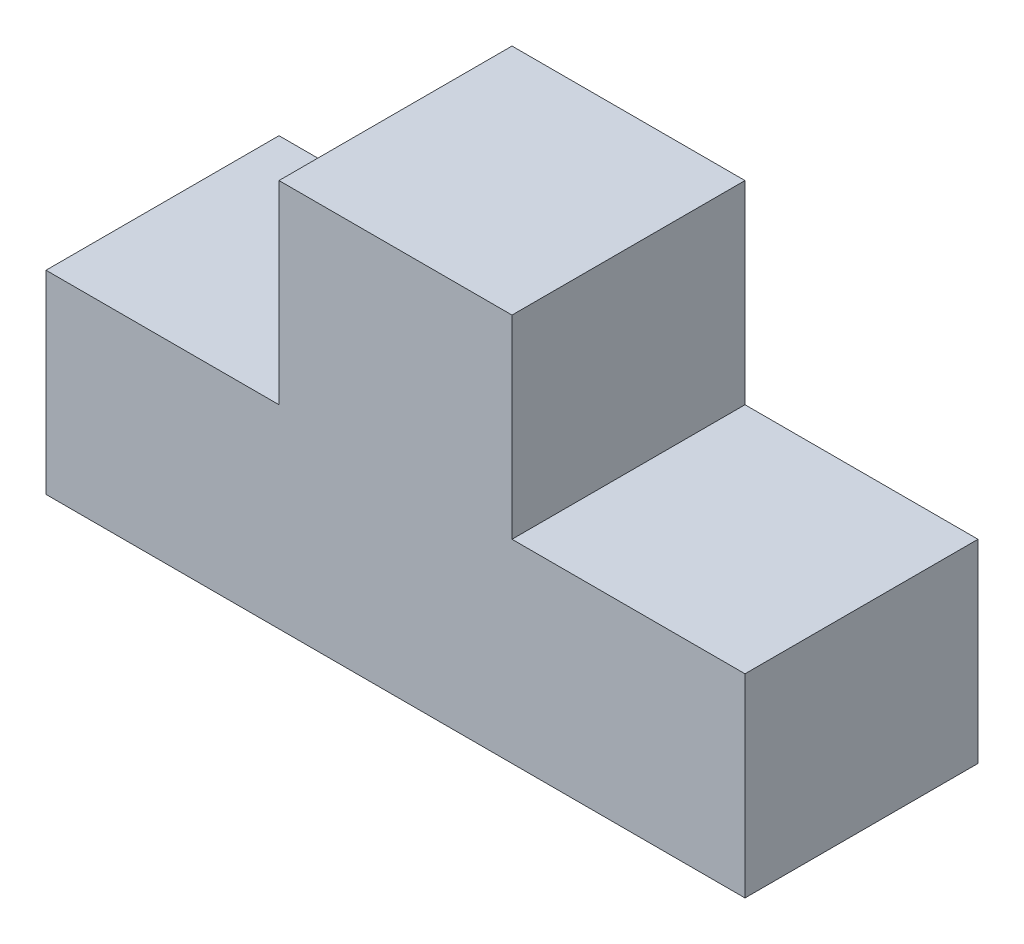
ISO-10303-21;
HEADER;
FILE_DESCRIPTION(('STEP AP214'),'2;1');
FILE_NAME('part.step','',(''),(''),'','','');
FILE_SCHEMA(('AUTOMOTIVE_DESIGN { 1 0 10303 214 1 1 1 1 }'));
ENDSEC;
DATA;
#1=APPLICATION_CONTEXT('core data for automotive mechanical design processes');
#2=APPLICATION_PROTOCOL_DEFINITION('international standard','automotive_design',2000,#1);
#3=PRODUCT_CONTEXT('',#1,'mechanical');
#4=PRODUCT('Part','Part','',(#3));
#5=PRODUCT_RELATED_PRODUCT_CATEGORY('part','',(#4));
#6=PRODUCT_DEFINITION_FORMATION('','',#4);
#7=PRODUCT_DEFINITION_CONTEXT('part definition',#1,'design');
#8=PRODUCT_DEFINITION('design','',#6,#7);
#9=PRODUCT_DEFINITION_SHAPE('','',#8);
#10=(LENGTH_UNIT() NAMED_UNIT(*) SI_UNIT(.MILLI.,.METRE.));
#11=(NAMED_UNIT(*) PLANE_ANGLE_UNIT() SI_UNIT($,.RADIAN.));
#12=(NAMED_UNIT(*) SI_UNIT($,.STERADIAN.) SOLID_ANGLE_UNIT());
#13=UNCERTAINTY_MEASURE_WITH_UNIT(LENGTH_MEASURE(1.E-05),#10,'distance_accuracy_value','');
#14=(GEOMETRIC_REPRESENTATION_CONTEXT(3) GLOBAL_UNCERTAINTY_ASSIGNED_CONTEXT((#13)) GLOBAL_UNIT_ASSIGNED_CONTEXT((#10,
#11,#12)) REPRESENTATION_CONTEXT('',''));
#15=CARTESIAN_POINT('',(0.,0.,0.));
#16=DIRECTION('',(0.,0.,1.));
#17=DIRECTION('',(1.,0.,0.));
#18=AXIS2_PLACEMENT_3D('',#15,#16,#17);
#19=CARTESIAN_POINT('',(0.,25.,30.));
#20=DIRECTION('',(1.,0.,0.));
#21=DIRECTION('',(0.,0.,-1.));
#22=AXIS2_PLACEMENT_3D('',#19,#20,#21);
#23=PLANE('',#22);
#24=DIRECTION('',(0.,-1.,0.));
#25=VECTOR('',#24,1.);
#26=CARTESIAN_POINT('',(0.,25.,0.));
#27=LINE('',#26,#25);
#28=CARTESIAN_POINT('',(0.,25.,0.));
#29=VERTEX_POINT('',#28);
#30=CARTESIAN_POINT('',(0.,0.,0.));
#31=VERTEX_POINT('',#30);
#32=EDGE_CURVE('E129',#29,#31,#27,.T.);
#33=ORIENTED_EDGE('',*,*,#32,.T.);
#34=DIRECTION('',(0.,0.,-1.));
#35=VECTOR('',#34,1.);
#36=CARTESIAN_POINT('',(0.,0.,30.));
#37=LINE('',#36,#35);
#38=CARTESIAN_POINT('',(0.,0.,30.));
#39=VERTEX_POINT('',#38);
#40=EDGE_CURVE('E11',#39,#31,#37,.T.);
#41=ORIENTED_EDGE('',*,*,#40,.F.);
#42=DIRECTION('',(0.,-1.,0.));
#43=VECTOR('',#42,1.);
#44=CARTESIAN_POINT('',(0.,25.,30.));
#45=LINE('',#44,#43);
#46=CARTESIAN_POINT('',(0.,25.,30.));
#47=VERTEX_POINT('',#46);
#48=EDGE_CURVE('E143',#47,#39,#45,.T.);
#49=ORIENTED_EDGE('',*,*,#48,.F.);
#50=DIRECTION('',(0.,0.,-1.));
#51=VECTOR('',#50,1.);
#52=CARTESIAN_POINT('',(0.,25.,30.));
#53=LINE('',#52,#51);
#54=EDGE_CURVE('E125',#47,#29,#53,.T.);
#55=ORIENTED_EDGE('',*,*,#54,.T.);
#56=EDGE_LOOP('',(#33,#41,#49,#55));
#57=FACE_BOUND('',#56,.T.);
#58=ADVANCED_FACE('F33',(#57),#23,.F.);
#59=CARTESIAN_POINT('',(0.,0.,30.));
#60=DIRECTION('',(0.,1.,0.));
#61=DIRECTION('',(0.,0.,1.));
#62=AXIS2_PLACEMENT_3D('',#59,#60,#61);
#63=PLANE('',#62);
#64=DIRECTION('',(1.,0.,0.));
#65=VECTOR('',#64,1.);
#66=CARTESIAN_POINT('',(0.,0.,0.));
#67=LINE('',#66,#65);
#68=CARTESIAN_POINT('',(90.,0.,0.));
#69=VERTEX_POINT('',#68);
#70=EDGE_CURVE('E132',#31,#69,#67,.T.);
#71=ORIENTED_EDGE('',*,*,#70,.T.);
#72=DIRECTION('',(0.,0.,-1.));
#73=VECTOR('',#72,1.);
#74=CARTESIAN_POINT('',(90.,0.,30.));
#75=LINE('',#74,#73);
#76=CARTESIAN_POINT('',(90.,0.,30.));
#77=VERTEX_POINT('',#76);
#78=EDGE_CURVE('E41',#77,#69,#75,.T.);
#79=ORIENTED_EDGE('',*,*,#78,.F.);
#80=DIRECTION('',(1.,0.,0.));
#81=VECTOR('',#80,1.);
#82=CARTESIAN_POINT('',(0.,0.,30.));
#83=LINE('',#82,#81);
#84=EDGE_CURVE('E92',#39,#77,#83,.T.);
#85=ORIENTED_EDGE('',*,*,#84,.F.);
#86=ORIENTED_EDGE('',*,*,#40,.T.);
#87=EDGE_LOOP('',(#71,#79,#85,#86));
#88=FACE_BOUND('',#87,.T.);
#89=ADVANCED_FACE('F178',(#88),#63,.F.);
#90=CARTESIAN_POINT('',(90.,0.,30.));
#91=DIRECTION('',(-1.,0.,0.));
#92=DIRECTION('',(0.,0.,1.));
#93=AXIS2_PLACEMENT_3D('',#90,#91,#92);
#94=PLANE('',#93);
#95=DIRECTION('',(0.,1.,0.));
#96=VECTOR('',#95,1.);
#97=CARTESIAN_POINT('',(90.,0.,0.));
#98=LINE('',#97,#96);
#99=CARTESIAN_POINT('',(90.,25.,0.));
#100=VERTEX_POINT('',#99);
#101=EDGE_CURVE('E134',#69,#100,#98,.T.);
#102=ORIENTED_EDGE('',*,*,#101,.T.);
#103=DIRECTION('',(0.,0.,-1.));
#104=VECTOR('',#103,1.);
#105=CARTESIAN_POINT('',(90.,25.,30.));
#106=LINE('',#105,#104);
#107=CARTESIAN_POINT('',(90.,25.,30.));
#108=VERTEX_POINT('',#107);
#109=EDGE_CURVE('E150',#108,#100,#106,.T.);
#110=ORIENTED_EDGE('',*,*,#109,.F.);
#111=DIRECTION('',(0.,1.,0.));
#112=VECTOR('',#111,1.);
#113=CARTESIAN_POINT('',(90.,0.,30.));
#114=LINE('',#113,#112);
#115=EDGE_CURVE('E158',#77,#108,#114,.T.);
#116=ORIENTED_EDGE('',*,*,#115,.F.);
#117=ORIENTED_EDGE('',*,*,#78,.T.);
#118=EDGE_LOOP('',(#102,#110,#116,#117));
#119=FACE_BOUND('',#118,.T.);
#120=ADVANCED_FACE('F156',(#119),#94,.F.);
#121=CARTESIAN_POINT('',(90.,25.,30.));
#122=DIRECTION('',(0.,-1.,0.));
#123=DIRECTION('',(1.,0.,0.));
#124=AXIS2_PLACEMENT_3D('',#121,#122,#123);
#125=PLANE('',#124);
#126=DIRECTION('',(-1.,0.,0.));
#127=VECTOR('',#126,1.);
#128=CARTESIAN_POINT('',(90.,25.,0.));
#129=LINE('',#128,#127);
#130=CARTESIAN_POINT('',(60.,25.,0.));
#131=VERTEX_POINT('',#130);
#132=EDGE_CURVE('E136',#100,#131,#129,.T.);
#133=ORIENTED_EDGE('',*,*,#132,.T.);
#134=DIRECTION('',(0.,0.,-1.));
#135=VECTOR('',#134,1.);
#136=CARTESIAN_POINT('',(60.,25.,30.));
#137=LINE('',#136,#135);
#138=CARTESIAN_POINT('',(60.,25.,30.));
#139=VERTEX_POINT('',#138);
#140=EDGE_CURVE('E147',#139,#131,#137,.T.);
#141=ORIENTED_EDGE('',*,*,#140,.F.);
#142=DIRECTION('',(-1.,0.,0.));
#143=VECTOR('',#142,1.);
#144=CARTESIAN_POINT('',(90.,25.,30.));
#145=LINE('',#144,#143);
#146=EDGE_CURVE('E170',#108,#139,#145,.T.);
#147=ORIENTED_EDGE('',*,*,#146,.F.);
#148=ORIENTED_EDGE('',*,*,#109,.T.);
#149=EDGE_LOOP('',(#133,#141,#147,#148));
#150=FACE_BOUND('',#149,.T.);
#151=ADVANCED_FACE('F166',(#150),#125,.F.);
#152=CARTESIAN_POINT('',(60.,25.,30.));
#153=DIRECTION('',(-1.,0.,0.));
#154=DIRECTION('',(0.,-1.,0.));
#155=AXIS2_PLACEMENT_3D('',#152,#153,#154);
#156=PLANE('',#155);
#157=DIRECTION('',(0.,1.,0.));
#158=VECTOR('',#157,1.);
#159=CARTESIAN_POINT('',(60.,25.,0.));
#160=LINE('',#159,#158);
#161=CARTESIAN_POINT('',(60.,50.,0.));
#162=VERTEX_POINT('',#161);
#163=EDGE_CURVE('E138',#131,#162,#160,.T.);
#164=ORIENTED_EDGE('',*,*,#163,.T.);
#165=DIRECTION('',(0.,0.,-1.));
#166=VECTOR('',#165,1.);
#167=CARTESIAN_POINT('',(60.,50.,30.));
#168=LINE('',#167,#166);
#169=CARTESIAN_POINT('',(60.,50.,30.));
#170=VERTEX_POINT('',#169);
#171=EDGE_CURVE('E120',#170,#162,#168,.T.);
#172=ORIENTED_EDGE('',*,*,#171,.F.);
#173=DIRECTION('',(0.,1.,0.));
#174=VECTOR('',#173,1.);
#175=CARTESIAN_POINT('',(60.,25.,30.));
#176=LINE('',#175,#174);
#177=EDGE_CURVE('E111',#139,#170,#176,.T.);
#178=ORIENTED_EDGE('',*,*,#177,.F.);
#179=ORIENTED_EDGE('',*,*,#140,.T.);
#180=EDGE_LOOP('',(#164,#172,#178,#179));
#181=FACE_BOUND('',#180,.T.);
#182=ADVANCED_FACE('F169',(#181),#156,.F.);
#183=CARTESIAN_POINT('',(60.,50.,30.));
#184=DIRECTION('',(0.,-1.,0.));
#185=DIRECTION('',(1.,0.,0.));
#186=AXIS2_PLACEMENT_3D('',#183,#184,#185);
#187=PLANE('',#186);
#188=DIRECTION('',(-1.,0.,0.));
#189=VECTOR('',#188,1.);
#190=CARTESIAN_POINT('',(60.,50.,0.));
#191=LINE('',#190,#189);
#192=CARTESIAN_POINT('',(30.,50.,0.));
#193=VERTEX_POINT('',#192);
#194=EDGE_CURVE('E119',#162,#193,#191,.T.);
#195=ORIENTED_EDGE('',*,*,#194,.T.);
#196=DIRECTION('',(0.,0.,-1.));
#197=VECTOR('',#196,1.);
#198=CARTESIAN_POINT('',(30.,50.,30.));
#199=LINE('',#198,#197);
#200=CARTESIAN_POINT('',(30.,50.,30.));
#201=VERTEX_POINT('',#200);
#202=EDGE_CURVE('E116',#201,#193,#199,.T.);
#203=ORIENTED_EDGE('',*,*,#202,.F.);
#204=DIRECTION('',(-1.,0.,0.));
#205=VECTOR('',#204,1.);
#206=CARTESIAN_POINT('',(60.,50.,30.));
#207=LINE('',#206,#205);
#208=EDGE_CURVE('E105',#170,#201,#207,.T.);
#209=ORIENTED_EDGE('',*,*,#208,.F.);
#210=ORIENTED_EDGE('',*,*,#171,.T.);
#211=EDGE_LOOP('',(#195,#203,#209,#210));
#212=FACE_BOUND('',#211,.T.);
#213=ADVANCED_FACE('F117',(#212),#187,.F.);
#214=CARTESIAN_POINT('',(30.,50.,30.));
#215=DIRECTION('',(1.,0.,0.));
#216=DIRECTION('',(0.,1.,0.));
#217=AXIS2_PLACEMENT_3D('',#214,#215,#216);
#218=PLANE('',#217);
#219=DIRECTION('',(0.,-1.,0.));
#220=VECTOR('',#219,1.);
#221=CARTESIAN_POINT('',(30.,50.,0.));
#222=LINE('',#221,#220);
#223=CARTESIAN_POINT('',(30.,25.,0.));
#224=VERTEX_POINT('',#223);
#225=EDGE_CURVE('E78',#193,#224,#222,.T.);
#226=ORIENTED_EDGE('',*,*,#225,.T.);
#227=DIRECTION('',(0.,0.,-1.));
#228=VECTOR('',#227,1.);
#229=CARTESIAN_POINT('',(30.,25.,30.));
#230=LINE('',#229,#228);
#231=CARTESIAN_POINT('',(30.,25.,30.));
#232=VERTEX_POINT('',#231);
#233=EDGE_CURVE('E121',#232,#224,#230,.T.);
#234=ORIENTED_EDGE('',*,*,#233,.F.);
#235=DIRECTION('',(0.,-1.,0.));
#236=VECTOR('',#235,1.);
#237=CARTESIAN_POINT('',(30.,50.,30.));
#238=LINE('',#237,#236);
#239=EDGE_CURVE('E109',#201,#232,#238,.T.);
#240=ORIENTED_EDGE('',*,*,#239,.F.);
#241=ORIENTED_EDGE('',*,*,#202,.T.);
#242=EDGE_LOOP('',(#226,#234,#240,#241));
#243=FACE_BOUND('',#242,.T.);
#244=ADVANCED_FACE('F123',(#243),#218,.F.);
#245=CARTESIAN_POINT('',(30.,25.,30.));
#246=DIRECTION('',(0.,-1.,0.));
#247=DIRECTION('',(1.,0.,0.));
#248=AXIS2_PLACEMENT_3D('',#245,#246,#247);
#249=PLANE('',#248);
#250=DIRECTION('',(-1.,0.,0.));
#251=VECTOR('',#250,1.);
#252=CARTESIAN_POINT('',(30.,25.,0.));
#253=LINE('',#252,#251);
#254=EDGE_CURVE('E84',#224,#29,#253,.T.);
#255=ORIENTED_EDGE('',*,*,#254,.T.);
#256=ORIENTED_EDGE('',*,*,#54,.F.);
#257=DIRECTION('',(-1.,0.,0.));
#258=VECTOR('',#257,1.);
#259=CARTESIAN_POINT('',(30.,25.,30.));
#260=LINE('',#259,#258);
#261=EDGE_CURVE('E49',#232,#47,#260,.T.);
#262=ORIENTED_EDGE('',*,*,#261,.F.);
#263=ORIENTED_EDGE('',*,*,#233,.T.);
#264=EDGE_LOOP('',(#255,#256,#262,#263));
#265=FACE_BOUND('',#264,.T.);
#266=ADVANCED_FACE('F194',(#265),#249,.F.);
#267=CARTESIAN_POINT('',(0.,0.,30.));
#268=DIRECTION('',(0.,0.,1.));
#269=DIRECTION('',(1.,0.,0.));
#270=AXIS2_PLACEMENT_3D('',#267,#268,#269);
#271=PLANE('',#270);
#272=ORIENTED_EDGE('',*,*,#48,.T.);
#273=ORIENTED_EDGE('',*,*,#84,.T.);
#274=ORIENTED_EDGE('',*,*,#115,.T.);
#275=ORIENTED_EDGE('',*,*,#146,.T.);
#276=ORIENTED_EDGE('',*,*,#177,.T.);
#277=ORIENTED_EDGE('',*,*,#208,.T.);
#278=ORIENTED_EDGE('',*,*,#239,.T.);
#279=ORIENTED_EDGE('',*,*,#261,.T.);
#280=EDGE_LOOP('',(#272,#273,#274,#275,#276,#277,#278,#279));
#281=FACE_BOUND('',#280,.T.);
#282=ADVANCED_FACE('F107',(#281),#271,.T.);
#283=CARTESIAN_POINT('',(0.,0.,0.));
#284=DIRECTION('',(0.,0.,1.));
#285=DIRECTION('',(1.,0.,0.));
#286=AXIS2_PLACEMENT_3D('',#283,#284,#285);
#287=PLANE('',#286);
#288=ORIENTED_EDGE('',*,*,#32,.F.);
#289=ORIENTED_EDGE('',*,*,#254,.F.);
#290=ORIENTED_EDGE('',*,*,#225,.F.);
#291=ORIENTED_EDGE('',*,*,#194,.F.);
#292=ORIENTED_EDGE('',*,*,#163,.F.);
#293=ORIENTED_EDGE('',*,*,#132,.F.);
#294=ORIENTED_EDGE('',*,*,#101,.F.);
#295=ORIENTED_EDGE('',*,*,#70,.F.);
#296=EDGE_LOOP('',(#288,#289,#290,#291,#292,#293,#294,#295));
#297=FACE_BOUND('',#296,.T.);
#298=ADVANCED_FACE('F162',(#297),#287,.F.);
#299=CLOSED_SHELL('',(#58,#89,#120,#151,#182,#213,#244,#266,#282,#298));
#300=MANIFOLD_SOLID_BREP('B2',#299);
#301=ADVANCED_BREP_SHAPE_REPRESENTATION('',(#18,#300),#14);
#302=SHAPE_DEFINITION_REPRESENTATION(#9,#301);
ENDSEC;
END-ISO-10303-21;
